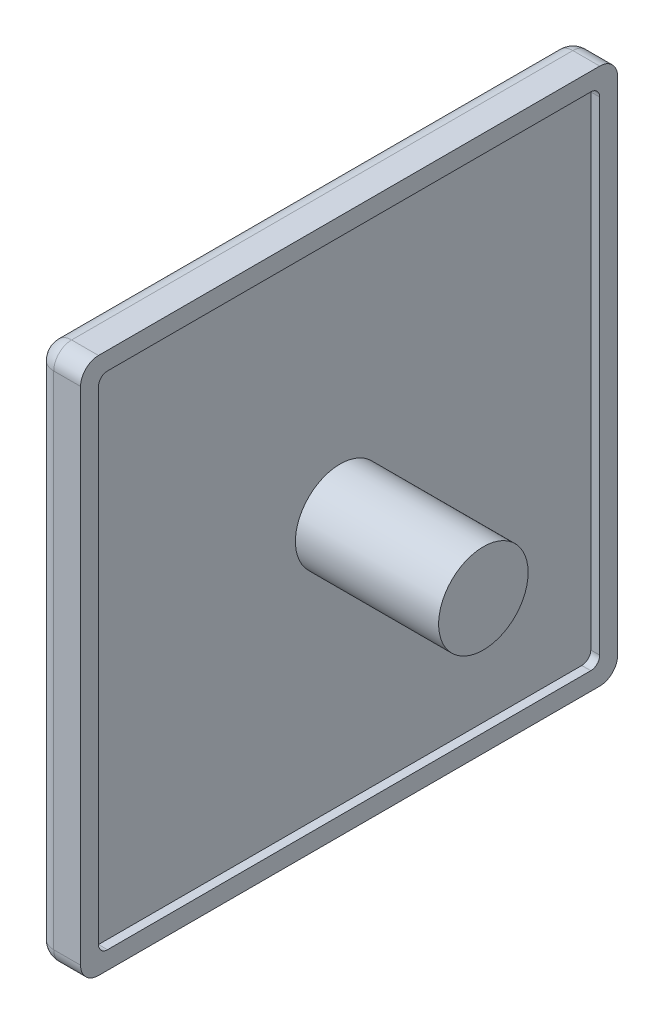
ISO-10303-21;
HEADER;
FILE_DESCRIPTION(('STEP AP214'),'2;1');
FILE_NAME('part.step','',(''),(''),'','','');
FILE_SCHEMA(('AUTOMOTIVE_DESIGN { 1 0 10303 214 1 1 1 1 }'));
ENDSEC;
DATA;
#1=APPLICATION_CONTEXT('core data for automotive mechanical design processes');
#2=APPLICATION_PROTOCOL_DEFINITION('international standard','automotive_design',2000,#1);
#3=PRODUCT_CONTEXT('',#1,'mechanical');
#4=PRODUCT('Part','Part','',(#3));
#5=PRODUCT_RELATED_PRODUCT_CATEGORY('part','',(#4));
#6=PRODUCT_DEFINITION_FORMATION('','',#4);
#7=PRODUCT_DEFINITION_CONTEXT('part definition',#1,'design');
#8=PRODUCT_DEFINITION('design','',#6,#7);
#9=PRODUCT_DEFINITION_SHAPE('','',#8);
#10=(LENGTH_UNIT() NAMED_UNIT(*) SI_UNIT(.MILLI.,.METRE.));
#11=(NAMED_UNIT(*) PLANE_ANGLE_UNIT() SI_UNIT($,.RADIAN.));
#12=(NAMED_UNIT(*) SI_UNIT($,.STERADIAN.) SOLID_ANGLE_UNIT());
#13=UNCERTAINTY_MEASURE_WITH_UNIT(LENGTH_MEASURE(1.E-05),#10,'distance_accuracy_value','');
#14=(GEOMETRIC_REPRESENTATION_CONTEXT(3) GLOBAL_UNCERTAINTY_ASSIGNED_CONTEXT((#13)) GLOBAL_UNIT_ASSIGNED_CONTEXT((#10,
#11,#12)) REPRESENTATION_CONTEXT('',''));
#15=CARTESIAN_POINT('',(0.,0.,0.));
#16=DIRECTION('',(0.,0.,1.));
#17=DIRECTION('',(1.,0.,0.));
#18=AXIS2_PLACEMENT_3D('',#15,#16,#17);
#19=CARTESIAN_POINT('',(2.5,0.,0.));
#20=DIRECTION('',(0.,0.,-1.));
#21=DIRECTION('',(-1.,0.,0.));
#22=AXIS2_PLACEMENT_3D('',#19,#20,#21);
#23=PLANE('',#22);
#24=DIRECTION('',(0.,-1.,0.));
#25=VECTOR('',#24,1.);
#26=CARTESIAN_POINT('',(2.5,0.,0.));
#27=LINE('',#26,#25);
#28=CARTESIAN_POINT('',(2.5,29.,0.));
#29=VERTEX_POINT('',#28);
#30=CARTESIAN_POINT('',(2.5,1.,0.));
#31=VERTEX_POINT('',#30);
#32=EDGE_CURVE('E326',#29,#31,#27,.T.);
#33=ORIENTED_EDGE('',*,*,#32,.F.);
#34=DIRECTION('',(-1.,0.,0.));
#35=VECTOR('',#34,1.);
#36=CARTESIAN_POINT('',(2.5,29.,0.));
#37=LINE('',#36,#35);
#38=CARTESIAN_POINT('',(1.,29.,0.));
#39=VERTEX_POINT('',#38);
#40=EDGE_CURVE('E228',#29,#39,#37,.T.);
#41=ORIENTED_EDGE('',*,*,#40,.T.);
#42=DIRECTION('',(0.,-1.,0.));
#43=VECTOR('',#42,1.);
#44=CARTESIAN_POINT('',(1.,0.,0.));
#45=LINE('',#44,#43);
#46=CARTESIAN_POINT('',(1.,1.,0.));
#47=VERTEX_POINT('',#46);
#48=EDGE_CURVE('E176',#39,#47,#45,.T.);
#49=ORIENTED_EDGE('',*,*,#48,.T.);
#50=DIRECTION('',(-1.,0.,0.));
#51=VECTOR('',#50,1.);
#52=CARTESIAN_POINT('',(2.5,1.,0.));
#53=LINE('',#52,#51);
#54=EDGE_CURVE('E226',#47,#31,#53,.F.);
#55=ORIENTED_EDGE('',*,*,#54,.T.);
#56=EDGE_LOOP('',(#33,#41,#49,#55));
#57=FACE_BOUND('',#56,.T.);
#58=ADVANCED_FACE('F41',(#57),#23,.F.);
#59=CARTESIAN_POINT('',(2.5,0.,0.));
#60=DIRECTION('',(0.,1.,0.));
#61=DIRECTION('',(0.,0.,1.));
#62=AXIS2_PLACEMENT_3D('',#59,#60,#61);
#63=PLANE('',#62);
#64=DIRECTION('',(0.,0.,-1.));
#65=VECTOR('',#64,1.);
#66=CARTESIAN_POINT('',(1.,0.,-30.));
#67=LINE('',#66,#65);
#68=CARTESIAN_POINT('',(1.,0.,-1.));
#69=VERTEX_POINT('',#68);
#70=CARTESIAN_POINT('',(1.,0.,-29.));
#71=VERTEX_POINT('',#70);
#72=EDGE_CURVE('E187',#69,#71,#67,.T.);
#73=ORIENTED_EDGE('',*,*,#72,.T.);
#74=DIRECTION('',(-1.,0.,0.));
#75=VECTOR('',#74,1.);
#76=CARTESIAN_POINT('',(2.5,0.,-29.));
#77=LINE('',#76,#75);
#78=CARTESIAN_POINT('',(2.5,0.,-29.));
#79=VERTEX_POINT('',#78);
#80=EDGE_CURVE('E248',#71,#79,#77,.F.);
#81=ORIENTED_EDGE('',*,*,#80,.T.);
#82=DIRECTION('',(0.,0.,-1.));
#83=VECTOR('',#82,1.);
#84=CARTESIAN_POINT('',(2.5,0.,0.));
#85=LINE('',#84,#83);
#86=CARTESIAN_POINT('',(2.5,0.,-1.));
#87=VERTEX_POINT('',#86);
#88=EDGE_CURVE('E335',#87,#79,#85,.T.);
#89=ORIENTED_EDGE('',*,*,#88,.F.);
#90=DIRECTION('',(-1.,0.,0.));
#91=VECTOR('',#90,1.);
#92=CARTESIAN_POINT('',(2.5,0.,-1.));
#93=LINE('',#92,#91);
#94=EDGE_CURVE('E246',#87,#69,#93,.T.);
#95=ORIENTED_EDGE('',*,*,#94,.T.);
#96=EDGE_LOOP('',(#73,#81,#89,#95));
#97=FACE_BOUND('',#96,.T.);
#98=ADVANCED_FACE('F373',(#97),#63,.F.);
#99=CARTESIAN_POINT('',(2.5,0.,-30.));
#100=DIRECTION('',(0.,0.,1.));
#101=DIRECTION('',(1.,0.,0.));
#102=AXIS2_PLACEMENT_3D('',#99,#100,#101);
#103=PLANE('',#102);
#104=DIRECTION('',(0.,1.,0.));
#105=VECTOR('',#104,1.);
#106=CARTESIAN_POINT('',(1.,30.,-30.));
#107=LINE('',#106,#105);
#108=CARTESIAN_POINT('',(1.,1.,-30.));
#109=VERTEX_POINT('',#108);
#110=CARTESIAN_POINT('',(1.,29.,-30.));
#111=VERTEX_POINT('',#110);
#112=EDGE_CURVE('E205',#109,#111,#107,.T.);
#113=ORIENTED_EDGE('',*,*,#112,.T.);
#114=DIRECTION('',(-1.,0.,0.));
#115=VECTOR('',#114,1.);
#116=CARTESIAN_POINT('',(2.5,29.,-30.));
#117=LINE('',#116,#115);
#118=CARTESIAN_POINT('',(2.5,29.,-30.));
#119=VERTEX_POINT('',#118);
#120=EDGE_CURVE('E244',#111,#119,#117,.F.);
#121=ORIENTED_EDGE('',*,*,#120,.T.);
#122=DIRECTION('',(0.,1.,0.));
#123=VECTOR('',#122,1.);
#124=CARTESIAN_POINT('',(2.5,0.,-30.));
#125=LINE('',#124,#123);
#126=CARTESIAN_POINT('',(2.5,1.,-30.));
#127=VERTEX_POINT('',#126);
#128=EDGE_CURVE('E338',#127,#119,#125,.T.);
#129=ORIENTED_EDGE('',*,*,#128,.F.);
#130=DIRECTION('',(-1.,0.,0.));
#131=VECTOR('',#130,1.);
#132=CARTESIAN_POINT('',(2.5,1.,-30.));
#133=LINE('',#132,#131);
#134=EDGE_CURVE('E242',#127,#109,#133,.T.);
#135=ORIENTED_EDGE('',*,*,#134,.T.);
#136=EDGE_LOOP('',(#113,#121,#129,#135));
#137=FACE_BOUND('',#136,.T.);
#138=ADVANCED_FACE('F361',(#137),#103,.F.);
#139=CARTESIAN_POINT('',(2.5,30.,0.));
#140=DIRECTION('',(0.,-1.,0.));
#141=DIRECTION('',(0.,0.,-1.));
#142=AXIS2_PLACEMENT_3D('',#139,#140,#141);
#143=PLANE('',#142);
#144=DIRECTION('',(0.,0.,1.));
#145=VECTOR('',#144,1.);
#146=CARTESIAN_POINT('',(1.,30.,0.));
#147=LINE('',#146,#145);
#148=CARTESIAN_POINT('',(1.,30.,-29.));
#149=VERTEX_POINT('',#148);
#150=CARTESIAN_POINT('',(1.,30.,-1.));
#151=VERTEX_POINT('',#150);
#152=EDGE_CURVE('E208',#149,#151,#147,.T.);
#153=ORIENTED_EDGE('',*,*,#152,.T.);
#154=DIRECTION('',(-1.,0.,0.));
#155=VECTOR('',#154,1.);
#156=CARTESIAN_POINT('',(2.5,30.,-1.));
#157=LINE('',#156,#155);
#158=CARTESIAN_POINT('',(2.5,30.,-1.));
#159=VERTEX_POINT('',#158);
#160=EDGE_CURVE('E232',#151,#159,#157,.F.);
#161=ORIENTED_EDGE('',*,*,#160,.T.);
#162=DIRECTION('',(0.,0.,1.));
#163=VECTOR('',#162,1.);
#164=CARTESIAN_POINT('',(2.5,30.,0.));
#165=LINE('',#164,#163);
#166=CARTESIAN_POINT('',(2.5,30.,-29.));
#167=VERTEX_POINT('',#166);
#168=EDGE_CURVE('E341',#167,#159,#165,.T.);
#169=ORIENTED_EDGE('',*,*,#168,.F.);
#170=DIRECTION('',(-1.,0.,0.));
#171=VECTOR('',#170,1.);
#172=CARTESIAN_POINT('',(2.5,30.,-29.));
#173=LINE('',#172,#171);
#174=EDGE_CURVE('E230',#167,#149,#173,.T.);
#175=ORIENTED_EDGE('',*,*,#174,.T.);
#176=EDGE_LOOP('',(#153,#161,#169,#175));
#177=FACE_BOUND('',#176,.T.);
#178=ADVANCED_FACE('F392',(#177),#143,.F.);
#179=CARTESIAN_POINT('',(2.5,0.,0.));
#180=DIRECTION('',(-1.,0.,0.));
#181=DIRECTION('',(0.,0.,1.));
#182=AXIS2_PLACEMENT_3D('',#179,#180,#181);
#183=PLANE('',#182);
#184=DIRECTION('',(0.,0.,-1.));
#185=VECTOR('',#184,1.);
#186=CARTESIAN_POINT('',(2.5,1.,-1.));
#187=LINE('',#186,#185);
#188=CARTESIAN_POINT('',(2.5,1.,-1.5));
#189=VERTEX_POINT('',#188);
#190=CARTESIAN_POINT('',(2.5,1.,-28.5));
#191=VERTEX_POINT('',#190);
#192=EDGE_CURVE('E328',#189,#191,#187,.T.);
#193=ORIENTED_EDGE('',*,*,#192,.F.);
#194=CARTESIAN_POINT('',(2.5,1.5,-1.5));
#195=DIRECTION('',(-1.,0.,0.));
#196=DIRECTION('',(0.,0.,1.));
#197=AXIS2_PLACEMENT_3D('',#194,#195,#196);
#198=CIRCLE('',#197,0.5);
#199=CARTESIAN_POINT('',(2.5,1.50000000000001,-1.));
#200=VERTEX_POINT('',#199);
#201=EDGE_CURVE('E11',#189,#200,#198,.T.);
#202=ORIENTED_EDGE('',*,*,#201,.T.);
#203=DIRECTION('',(0.,-1.,0.));
#204=VECTOR('',#203,1.);
#205=CARTESIAN_POINT('',(2.5,29.,-1.));
#206=LINE('',#205,#204);
#207=CARTESIAN_POINT('',(2.5,28.5,-1.));
#208=VERTEX_POINT('',#207);
#209=EDGE_CURVE('E254',#208,#200,#206,.T.);
#210=ORIENTED_EDGE('',*,*,#209,.F.);
#211=CARTESIAN_POINT('',(2.5,28.5,-1.5));
#212=DIRECTION('',(-1.,0.,0.));
#213=DIRECTION('',(0.,0.,1.));
#214=AXIS2_PLACEMENT_3D('',#211,#212,#213);
#215=CIRCLE('',#214,0.5);
#216=CARTESIAN_POINT('',(2.5,29.,-1.5));
#217=VERTEX_POINT('',#216);
#218=EDGE_CURVE('E49',#208,#217,#215,.T.);
#219=ORIENTED_EDGE('',*,*,#218,.T.);
#220=DIRECTION('',(0.,0.,1.));
#221=VECTOR('',#220,1.);
#222=CARTESIAN_POINT('',(2.5,29.,-1.));
#223=LINE('',#222,#221);
#224=CARTESIAN_POINT('',(2.5,29.,-28.5));
#225=VERTEX_POINT('',#224);
#226=EDGE_CURVE('E294',#225,#217,#223,.T.);
#227=ORIENTED_EDGE('',*,*,#226,.F.);
#228=CARTESIAN_POINT('',(2.5,28.5,-28.5));
#229=DIRECTION('',(-1.,0.,0.));
#230=DIRECTION('',(0.,0.,1.));
#231=AXIS2_PLACEMENT_3D('',#228,#229,#230);
#232=CIRCLE('',#231,0.5);
#233=CARTESIAN_POINT('',(2.5,28.5,-29.));
#234=VERTEX_POINT('',#233);
#235=EDGE_CURVE('E289',#225,#234,#232,.T.);
#236=ORIENTED_EDGE('',*,*,#235,.T.);
#237=DIRECTION('',(0.,1.,0.));
#238=VECTOR('',#237,1.);
#239=CARTESIAN_POINT('',(2.5,29.,-29.));
#240=LINE('',#239,#238);
#241=CARTESIAN_POINT('',(2.5,1.50000000000001,-29.));
#242=VERTEX_POINT('',#241);
#243=EDGE_CURVE('E301',#242,#234,#240,.T.);
#244=ORIENTED_EDGE('',*,*,#243,.F.);
#245=CARTESIAN_POINT('',(2.5,1.5,-28.5));
#246=DIRECTION('',(-1.,0.,0.));
#247=DIRECTION('',(0.,0.,1.));
#248=AXIS2_PLACEMENT_3D('',#245,#246,#247);
#249=CIRCLE('',#248,0.5);
#250=EDGE_CURVE('E287',#242,#191,#249,.T.);
#251=ORIENTED_EDGE('',*,*,#250,.T.);
#252=EDGE_LOOP('',(#193,#202,#210,#219,#227,#236,#244,#251));
#253=FACE_BOUND('',#252,.T.);
#254=ORIENTED_EDGE('',*,*,#168,.T.);
#255=CARTESIAN_POINT('',(2.5,29.,-1.));
#256=DIRECTION('',(-1.,0.,0.));
#257=DIRECTION('',(0.,0.,1.));
#258=AXIS2_PLACEMENT_3D('',#255,#256,#257);
#259=CIRCLE('',#258,1.);
#260=EDGE_CURVE('E240',#159,#29,#259,.F.);
#261=ORIENTED_EDGE('',*,*,#260,.T.);
#262=ORIENTED_EDGE('',*,*,#32,.T.);
#263=CARTESIAN_POINT('',(2.5,1.,-1.));
#264=DIRECTION('',(-1.,0.,0.));
#265=DIRECTION('',(0.,0.,1.));
#266=AXIS2_PLACEMENT_3D('',#263,#264,#265);
#267=CIRCLE('',#266,1.);
#268=EDGE_CURVE('E234',#31,#87,#267,.F.);
#269=ORIENTED_EDGE('',*,*,#268,.T.);
#270=ORIENTED_EDGE('',*,*,#88,.T.);
#271=CARTESIAN_POINT('',(2.5,1.,-29.));
#272=DIRECTION('',(-1.,0.,0.));
#273=DIRECTION('',(0.,0.,1.));
#274=AXIS2_PLACEMENT_3D('',#271,#272,#273);
#275=CIRCLE('',#274,1.);
#276=EDGE_CURVE('E236',#79,#127,#275,.F.);
#277=ORIENTED_EDGE('',*,*,#276,.T.);
#278=ORIENTED_EDGE('',*,*,#128,.T.);
#279=CARTESIAN_POINT('',(2.5,29.,-29.));
#280=DIRECTION('',(-1.,0.,0.));
#281=DIRECTION('',(0.,0.,1.));
#282=AXIS2_PLACEMENT_3D('',#279,#280,#281);
#283=CIRCLE('',#282,1.);
#284=EDGE_CURVE('E238',#119,#167,#283,.F.);
#285=ORIENTED_EDGE('',*,*,#284,.T.);
#286=EDGE_LOOP('',(#254,#261,#262,#269,#270,#277,#278,#285));
#287=FACE_BOUND('',#286,.T.);
#288=ADVANCED_FACE('F292',(#253,#287),#183,.F.);
#289=CARTESIAN_POINT('',(0.,0.,0.));
#290=DIRECTION('',(-1.,0.,0.));
#291=DIRECTION('',(0.,0.,1.));
#292=AXIS2_PLACEMENT_3D('',#289,#290,#291);
#293=PLANE('',#292);
#294=DIRECTION('',(0.,1.,0.));
#295=VECTOR('',#294,1.);
#296=CARTESIAN_POINT('',(0.,0.,-29.));
#297=LINE('',#296,#295);
#298=CARTESIAN_POINT('',(0.,29.,-29.));
#299=VERTEX_POINT('',#298);
#300=CARTESIAN_POINT('',(0.,1.,-29.));
#301=VERTEX_POINT('',#300);
#302=EDGE_CURVE('E204',#299,#301,#297,.F.);
#303=ORIENTED_EDGE('',*,*,#302,.T.);
#304=DIRECTION('',(0.,0.,-1.));
#305=VECTOR('',#304,1.);
#306=CARTESIAN_POINT('',(0.,1.,0.));
#307=LINE('',#306,#305);
#308=CARTESIAN_POINT('',(0.,1.,-1.));
#309=VERTEX_POINT('',#308);
#310=EDGE_CURVE('E184',#301,#309,#307,.F.);
#311=ORIENTED_EDGE('',*,*,#310,.T.);
#312=DIRECTION('',(0.,-1.,0.));
#313=VECTOR('',#312,1.);
#314=CARTESIAN_POINT('',(0.,30.,-1.));
#315=LINE('',#314,#313);
#316=CARTESIAN_POINT('',(0.,29.,-1.));
#317=VERTEX_POINT('',#316);
#318=EDGE_CURVE('E193',#309,#317,#315,.F.);
#319=ORIENTED_EDGE('',*,*,#318,.T.);
#320=DIRECTION('',(0.,0.,1.));
#321=VECTOR('',#320,1.);
#322=CARTESIAN_POINT('',(0.,29.,-30.));
#323=LINE('',#322,#321);
#324=EDGE_CURVE('E199',#317,#299,#323,.F.);
#325=ORIENTED_EDGE('',*,*,#324,.T.);
#326=EDGE_LOOP('',(#303,#311,#319,#325));
#327=FACE_BOUND('',#326,.T.);
#328=ADVANCED_FACE('F202',(#327),#293,.T.);
#329=CARTESIAN_POINT('',(2.,29.,-1.));
#330=DIRECTION('',(0.,0.,1.));
#331=DIRECTION('',(0.,-1.,0.));
#332=AXIS2_PLACEMENT_3D('',#329,#330,#331);
#333=PLANE('',#332);
#334=DIRECTION('',(0.,-1.,0.));
#335=VECTOR('',#334,1.);
#336=CARTESIAN_POINT('',(2.,29.,-1.));
#337=LINE('',#336,#335);
#338=CARTESIAN_POINT('',(2.,28.5,-1.));
#339=VERTEX_POINT('',#338);
#340=CARTESIAN_POINT('',(2.,1.50000000000001,-1.));
#341=VERTEX_POINT('',#340);
#342=EDGE_CURVE('E300',#339,#341,#337,.T.);
#343=ORIENTED_EDGE('',*,*,#342,.F.);
#344=DIRECTION('',(1.,0.,0.));
#345=VECTOR('',#344,1.);
#346=CARTESIAN_POINT('',(2.5,28.5,-1.));
#347=LINE('',#346,#345);
#348=EDGE_CURVE('E285',#339,#208,#347,.T.);
#349=ORIENTED_EDGE('',*,*,#348,.T.);
#350=ORIENTED_EDGE('',*,*,#209,.T.);
#351=DIRECTION('',(1.,0.,0.));
#352=VECTOR('',#351,1.);
#353=CARTESIAN_POINT('',(2.,1.5,-1.));
#354=LINE('',#353,#352);
#355=EDGE_CURVE('E283',#200,#341,#354,.F.);
#356=ORIENTED_EDGE('',*,*,#355,.T.);
#357=EDGE_LOOP('',(#343,#349,#350,#356));
#358=FACE_BOUND('',#357,.T.);
#359=ADVANCED_FACE('F313',(#358),#333,.F.);
#360=CARTESIAN_POINT('',(2.,29.,-1.));
#361=DIRECTION('',(0.,1.,0.));
#362=DIRECTION('',(0.,0.,1.));
#363=AXIS2_PLACEMENT_3D('',#360,#361,#362);
#364=PLANE('',#363);
#365=DIRECTION('',(0.,0.,1.));
#366=VECTOR('',#365,1.);
#367=CARTESIAN_POINT('',(2.,29.,-1.));
#368=LINE('',#367,#366);
#369=CARTESIAN_POINT('',(2.,29.,-28.5));
#370=VERTEX_POINT('',#369);
#371=CARTESIAN_POINT('',(2.,29.,-1.5));
#372=VERTEX_POINT('',#371);
#373=EDGE_CURVE('E311',#370,#372,#368,.T.);
#374=ORIENTED_EDGE('',*,*,#373,.F.);
#375=DIRECTION('',(1.,0.,0.));
#376=VECTOR('',#375,1.);
#377=CARTESIAN_POINT('',(2.5,29.,-28.5));
#378=LINE('',#377,#376);
#379=EDGE_CURVE('E280',#370,#225,#378,.T.);
#380=ORIENTED_EDGE('',*,*,#379,.T.);
#381=ORIENTED_EDGE('',*,*,#226,.T.);
#382=DIRECTION('',(1.,0.,0.));
#383=VECTOR('',#382,1.);
#384=CARTESIAN_POINT('',(2.,29.,-1.5));
#385=LINE('',#384,#383);
#386=EDGE_CURVE('E278',#217,#372,#385,.F.);
#387=ORIENTED_EDGE('',*,*,#386,.T.);
#388=EDGE_LOOP('',(#374,#380,#381,#387));
#389=FACE_BOUND('',#388,.T.);
#390=ADVANCED_FACE('F297',(#389),#364,.F.);
#391=CARTESIAN_POINT('',(2.,29.,-29.));
#392=DIRECTION('',(0.,0.,-1.));
#393=DIRECTION('',(0.,1.,0.));
#394=AXIS2_PLACEMENT_3D('',#391,#392,#393);
#395=PLANE('',#394);
#396=DIRECTION('',(0.,1.,0.));
#397=VECTOR('',#396,1.);
#398=CARTESIAN_POINT('',(2.,29.,-29.));
#399=LINE('',#398,#397);
#400=CARTESIAN_POINT('',(2.,1.50000000000001,-29.));
#401=VERTEX_POINT('',#400);
#402=CARTESIAN_POINT('',(2.,28.5,-29.));
#403=VERTEX_POINT('',#402);
#404=EDGE_CURVE('E317',#401,#403,#399,.T.);
#405=ORIENTED_EDGE('',*,*,#404,.F.);
#406=DIRECTION('',(1.,0.,0.));
#407=VECTOR('',#406,1.);
#408=CARTESIAN_POINT('',(2.5,1.5,-29.));
#409=LINE('',#408,#407);
#410=EDGE_CURVE('E262',#401,#242,#409,.T.);
#411=ORIENTED_EDGE('',*,*,#410,.T.);
#412=ORIENTED_EDGE('',*,*,#243,.T.);
#413=DIRECTION('',(1.,0.,0.));
#414=VECTOR('',#413,1.);
#415=CARTESIAN_POINT('',(2.,28.5,-29.));
#416=LINE('',#415,#414);
#417=EDGE_CURVE('E250',#234,#403,#416,.F.);
#418=ORIENTED_EDGE('',*,*,#417,.T.);
#419=EDGE_LOOP('',(#405,#411,#412,#418));
#420=FACE_BOUND('',#419,.T.);
#421=ADVANCED_FACE('F462',(#420),#395,.F.);
#422=CARTESIAN_POINT('',(2.,1.,-1.));
#423=DIRECTION('',(0.,-1.,0.));
#424=DIRECTION('',(0.,0.,-1.));
#425=AXIS2_PLACEMENT_3D('',#422,#423,#424);
#426=PLANE('',#425);
#427=ORIENTED_EDGE('',*,*,#192,.T.);
#428=DIRECTION('',(1.,0.,0.));
#429=VECTOR('',#428,1.);
#430=CARTESIAN_POINT('',(2.,1.,-28.5));
#431=LINE('',#430,#429);
#432=CARTESIAN_POINT('',(2.,1.,-28.5));
#433=VERTEX_POINT('',#432);
#434=EDGE_CURVE('E268',#191,#433,#431,.F.);
#435=ORIENTED_EDGE('',*,*,#434,.T.);
#436=DIRECTION('',(0.,0.,-1.));
#437=VECTOR('',#436,1.);
#438=CARTESIAN_POINT('',(2.,1.,-1.));
#439=LINE('',#438,#437);
#440=CARTESIAN_POINT('',(2.,1.,-1.5));
#441=VERTEX_POINT('',#440);
#442=EDGE_CURVE('E315',#441,#433,#439,.T.);
#443=ORIENTED_EDGE('',*,*,#442,.F.);
#444=DIRECTION('',(1.,0.,0.));
#445=VECTOR('',#444,1.);
#446=CARTESIAN_POINT('',(2.5,1.,-1.5));
#447=LINE('',#446,#445);
#448=EDGE_CURVE('E265',#441,#189,#447,.T.);
#449=ORIENTED_EDGE('',*,*,#448,.T.);
#450=EDGE_LOOP('',(#427,#435,#443,#449));
#451=FACE_BOUND('',#450,.T.);
#452=ADVANCED_FACE('F456',(#451),#426,.F.);
#453=CARTESIAN_POINT('',(2.,0.,0.));
#454=DIRECTION('',(1.,0.,0.));
#455=DIRECTION('',(0.,0.,-1.));
#456=AXIS2_PLACEMENT_3D('',#453,#454,#455);
#457=PLANE('',#456);
#458=CARTESIAN_POINT('',(2.,15.,-15.));
#459=DIRECTION('',(1.,0.,0.));
#460=DIRECTION('',(0.,0.,-1.));
#461=AXIS2_PLACEMENT_3D('',#458,#459,#460);
#462=CIRCLE('',#461,2.5);
#463=CARTESIAN_POINT('',(2.,15.,-17.5));
#464=VERTEX_POINT('',#463);
#465=EDGE_CURVE('E320',#464,#464,#462,.T.);
#466=ORIENTED_EDGE('',*,*,#465,.F.);
#467=EDGE_LOOP('',(#466));
#468=FACE_BOUND('',#467,.T.);
#469=ORIENTED_EDGE('',*,*,#442,.T.);
#470=CARTESIAN_POINT('',(2.,1.5,-28.5));
#471=DIRECTION('',(1.,0.,0.));
#472=DIRECTION('',(0.,0.,-1.));
#473=AXIS2_PLACEMENT_3D('',#470,#471,#472);
#474=CIRCLE('',#473,0.5);
#475=EDGE_CURVE('E276',#433,#401,#474,.T.);
#476=ORIENTED_EDGE('',*,*,#475,.T.);
#477=ORIENTED_EDGE('',*,*,#404,.T.);
#478=CARTESIAN_POINT('',(2.,28.5,-28.5));
#479=DIRECTION('',(1.,0.,0.));
#480=DIRECTION('',(0.,0.,-1.));
#481=AXIS2_PLACEMENT_3D('',#478,#479,#480);
#482=CIRCLE('',#481,0.5);
#483=EDGE_CURVE('E274',#403,#370,#482,.T.);
#484=ORIENTED_EDGE('',*,*,#483,.T.);
#485=ORIENTED_EDGE('',*,*,#373,.T.);
#486=CARTESIAN_POINT('',(2.,28.5,-1.5));
#487=DIRECTION('',(1.,0.,0.));
#488=DIRECTION('',(0.,0.,-1.));
#489=AXIS2_PLACEMENT_3D('',#486,#487,#488);
#490=CIRCLE('',#489,0.5);
#491=EDGE_CURVE('E272',#372,#339,#490,.T.);
#492=ORIENTED_EDGE('',*,*,#491,.T.);
#493=ORIENTED_EDGE('',*,*,#342,.T.);
#494=CARTESIAN_POINT('',(2.,1.5,-1.5));
#495=DIRECTION('',(1.,0.,0.));
#496=DIRECTION('',(0.,0.,-1.));
#497=AXIS2_PLACEMENT_3D('',#494,#495,#496);
#498=CIRCLE('',#497,0.5);
#499=EDGE_CURVE('E270',#341,#441,#498,.T.);
#500=ORIENTED_EDGE('',*,*,#499,.T.);
#501=EDGE_LOOP('',(#469,#476,#477,#484,#485,#492,#493,#500));
#502=FACE_BOUND('',#501,.T.);
#503=ADVANCED_FACE('F309',(#468,#502),#457,.T.);
#504=CARTESIAN_POINT('',(1.,29.,0.));
#505=DIRECTION('',(0.,0.,-1.));
#506=DIRECTION('',(-1.,0.,0.));
#507=AXIS2_PLACEMENT_3D('',#504,#505,#506);
#508=CYLINDRICAL_SURFACE('',#507,1.);
#509=ORIENTED_EDGE('',*,*,#324,.F.);
#510=CARTESIAN_POINT('',(1.,29.,-1.));
#511=DIRECTION('',(0.,0.,-1.));
#512=DIRECTION('',(-1.,0.,0.));
#513=AXIS2_PLACEMENT_3D('',#510,#511,#512);
#514=CIRCLE('',#513,1.);
#515=EDGE_CURVE('E219',#317,#151,#514,.T.);
#516=ORIENTED_EDGE('',*,*,#515,.T.);
#517=ORIENTED_EDGE('',*,*,#152,.F.);
#518=CARTESIAN_POINT('',(1.,29.,-29.));
#519=DIRECTION('',(0.,0.,-1.));
#520=DIRECTION('',(-1.,0.,0.));
#521=AXIS2_PLACEMENT_3D('',#518,#519,#520);
#522=CIRCLE('',#521,1.);
#523=EDGE_CURVE('E217',#149,#299,#522,.F.);
#524=ORIENTED_EDGE('',*,*,#523,.T.);
#525=EDGE_LOOP('',(#509,#516,#517,#524));
#526=FACE_BOUND('',#525,.T.);
#527=ADVANCED_FACE('F390',(#526),#508,.T.);
#528=CARTESIAN_POINT('',(1.,0.,-1.));
#529=DIRECTION('',(0.,1.,0.));
#530=DIRECTION('',(0.,0.,1.));
#531=AXIS2_PLACEMENT_3D('',#528,#529,#530);
#532=CYLINDRICAL_SURFACE('',#531,1.);
#533=ORIENTED_EDGE('',*,*,#48,.F.);
#534=CARTESIAN_POINT('',(1.,29.,-1.));
#535=DIRECTION('',(0.,1.,0.));
#536=DIRECTION('',(0.,0.,1.));
#537=AXIS2_PLACEMENT_3D('',#534,#535,#536);
#538=CIRCLE('',#537,1.);
#539=EDGE_CURVE('E175',#39,#317,#538,.F.);
#540=ORIENTED_EDGE('',*,*,#539,.T.);
#541=ORIENTED_EDGE('',*,*,#318,.F.);
#542=CARTESIAN_POINT('',(1.,1.,-1.));
#543=DIRECTION('',(0.,1.,0.));
#544=DIRECTION('',(0.,0.,1.));
#545=AXIS2_PLACEMENT_3D('',#542,#543,#544);
#546=CIRCLE('',#545,1.);
#547=EDGE_CURVE('E165',#309,#47,#546,.T.);
#548=ORIENTED_EDGE('',*,*,#547,.T.);
#549=EDGE_LOOP('',(#533,#540,#541,#548));
#550=FACE_BOUND('',#549,.T.);
#551=ADVANCED_FACE('F194',(#550),#532,.T.);
#552=CARTESIAN_POINT('',(1.,0.,-29.));
#553=DIRECTION('',(0.,-1.,0.));
#554=DIRECTION('',(0.,0.,-1.));
#555=AXIS2_PLACEMENT_3D('',#552,#553,#554);
#556=CYLINDRICAL_SURFACE('',#555,1.);
#557=ORIENTED_EDGE('',*,*,#302,.F.);
#558=CARTESIAN_POINT('',(1.,29.,-29.));
#559=DIRECTION('',(0.,-1.,0.));
#560=DIRECTION('',(0.,0.,-1.));
#561=AXIS2_PLACEMENT_3D('',#558,#559,#560);
#562=CIRCLE('',#561,1.);
#563=EDGE_CURVE('E189',#299,#111,#562,.T.);
#564=ORIENTED_EDGE('',*,*,#563,.T.);
#565=ORIENTED_EDGE('',*,*,#112,.F.);
#566=CARTESIAN_POINT('',(1.,1.,-29.));
#567=DIRECTION('',(0.,-1.,0.));
#568=DIRECTION('',(0.,0.,-1.));
#569=AXIS2_PLACEMENT_3D('',#566,#567,#568);
#570=CIRCLE('',#569,1.);
#571=EDGE_CURVE('E221',#109,#301,#570,.F.);
#572=ORIENTED_EDGE('',*,*,#571,.T.);
#573=EDGE_LOOP('',(#557,#564,#565,#572));
#574=FACE_BOUND('',#573,.T.);
#575=ADVANCED_FACE('F347',(#574),#556,.T.);
#576=CARTESIAN_POINT('',(1.,1.,0.));
#577=DIRECTION('',(0.,0.,1.));
#578=DIRECTION('',(1.,0.,0.));
#579=AXIS2_PLACEMENT_3D('',#576,#577,#578);
#580=CYLINDRICAL_SURFACE('',#579,1.);
#581=ORIENTED_EDGE('',*,*,#310,.F.);
#582=CARTESIAN_POINT('',(1.,1.,-29.));
#583=DIRECTION('',(0.,0.,1.));
#584=DIRECTION('',(1.,0.,0.));
#585=AXIS2_PLACEMENT_3D('',#582,#583,#584);
#586=CIRCLE('',#585,1.);
#587=EDGE_CURVE('E188',#301,#71,#586,.T.);
#588=ORIENTED_EDGE('',*,*,#587,.T.);
#589=ORIENTED_EDGE('',*,*,#72,.F.);
#590=CARTESIAN_POINT('',(1.,1.,-1.));
#591=DIRECTION('',(0.,0.,1.));
#592=DIRECTION('',(1.,0.,0.));
#593=AXIS2_PLACEMENT_3D('',#590,#591,#592);
#594=CIRCLE('',#593,1.);
#595=EDGE_CURVE('E168',#69,#309,#594,.F.);
#596=ORIENTED_EDGE('',*,*,#595,.T.);
#597=EDGE_LOOP('',(#581,#588,#589,#596));
#598=FACE_BOUND('',#597,.T.);
#599=ADVANCED_FACE('F181',(#598),#580,.T.);
#600=CARTESIAN_POINT('',(2.5,29.,-1.));
#601=DIRECTION('',(-1.,0.,0.));
#602=DIRECTION('',(0.,0.,1.));
#603=AXIS2_PLACEMENT_3D('',#600,#601,#602);
#604=CYLINDRICAL_SURFACE('',#603,1.);
#605=ORIENTED_EDGE('',*,*,#260,.F.);
#606=ORIENTED_EDGE('',*,*,#160,.F.);
#607=CARTESIAN_POINT('',(1.,29.,-1.));
#608=DIRECTION('',(-1.,0.,0.));
#609=DIRECTION('',(0.,0.,1.));
#610=AXIS2_PLACEMENT_3D('',#607,#608,#609);
#611=CIRCLE('',#610,1.);
#612=EDGE_CURVE('E251',#39,#151,#611,.T.);
#613=ORIENTED_EDGE('',*,*,#612,.F.);
#614=ORIENTED_EDGE('',*,*,#40,.F.);
#615=EDGE_LOOP('',(#605,#606,#613,#614));
#616=FACE_BOUND('',#615,.T.);
#617=ADVANCED_FACE('F385',(#616),#604,.T.);
#618=CARTESIAN_POINT('',(1.,29.,-1.));
#619=DIRECTION('',(0.,0.,1.));
#620=DIRECTION('',(1.,0.,0.));
#621=AXIS2_PLACEMENT_3D('',#618,#619,#620);
#622=SPHERICAL_SURFACE('',#621,1.);
#623=ORIENTED_EDGE('',*,*,#612,.T.);
#624=ORIENTED_EDGE('',*,*,#515,.F.);
#625=ORIENTED_EDGE('',*,*,#539,.F.);
#626=EDGE_LOOP('',(#623,#624,#625));
#627=FACE_BOUND('',#626,.T.);
#628=ADVANCED_FACE('F388',(#627),#622,.T.);
#629=CARTESIAN_POINT('',(2.5,29.,-29.));
#630=DIRECTION('',(-1.,0.,0.));
#631=DIRECTION('',(0.,0.,1.));
#632=AXIS2_PLACEMENT_3D('',#629,#630,#631);
#633=CYLINDRICAL_SURFACE('',#632,1.);
#634=ORIENTED_EDGE('',*,*,#284,.F.);
#635=ORIENTED_EDGE('',*,*,#120,.F.);
#636=CARTESIAN_POINT('',(1.,29.,-29.));
#637=DIRECTION('',(-1.,0.,0.));
#638=DIRECTION('',(0.,0.,1.));
#639=AXIS2_PLACEMENT_3D('',#636,#637,#638);
#640=CIRCLE('',#639,1.);
#641=EDGE_CURVE('E255',#149,#111,#640,.T.);
#642=ORIENTED_EDGE('',*,*,#641,.F.);
#643=ORIENTED_EDGE('',*,*,#174,.F.);
#644=EDGE_LOOP('',(#634,#635,#642,#643));
#645=FACE_BOUND('',#644,.T.);
#646=ADVANCED_FACE('F358',(#645),#633,.T.);
#647=CARTESIAN_POINT('',(1.,29.,-29.));
#648=DIRECTION('',(0.,0.,1.));
#649=DIRECTION('',(1.,0.,0.));
#650=AXIS2_PLACEMENT_3D('',#647,#648,#649);
#651=SPHERICAL_SURFACE('',#650,1.);
#652=ORIENTED_EDGE('',*,*,#563,.F.);
#653=ORIENTED_EDGE('',*,*,#523,.F.);
#654=ORIENTED_EDGE('',*,*,#641,.T.);
#655=EDGE_LOOP('',(#652,#653,#654));
#656=FACE_BOUND('',#655,.T.);
#657=ADVANCED_FACE('F352',(#656),#651,.T.);
#658=CARTESIAN_POINT('',(2.5,1.,-29.));
#659=DIRECTION('',(-1.,0.,0.));
#660=DIRECTION('',(0.,0.,1.));
#661=AXIS2_PLACEMENT_3D('',#658,#659,#660);
#662=CYLINDRICAL_SURFACE('',#661,1.);
#663=ORIENTED_EDGE('',*,*,#276,.F.);
#664=ORIENTED_EDGE('',*,*,#80,.F.);
#665=CARTESIAN_POINT('',(1.,1.,-29.));
#666=DIRECTION('',(-1.,0.,0.));
#667=DIRECTION('',(0.,0.,1.));
#668=AXIS2_PLACEMENT_3D('',#665,#666,#667);
#669=CIRCLE('',#668,1.);
#670=EDGE_CURVE('E257',#109,#71,#669,.T.);
#671=ORIENTED_EDGE('',*,*,#670,.F.);
#672=ORIENTED_EDGE('',*,*,#134,.F.);
#673=EDGE_LOOP('',(#663,#664,#671,#672));
#674=FACE_BOUND('',#673,.T.);
#675=ADVANCED_FACE('F368',(#674),#662,.T.);
#676=CARTESIAN_POINT('',(1.,1.,-29.));
#677=DIRECTION('',(0.,0.,1.));
#678=DIRECTION('',(1.,0.,0.));
#679=AXIS2_PLACEMENT_3D('',#676,#677,#678);
#680=SPHERICAL_SURFACE('',#679,1.);
#681=ORIENTED_EDGE('',*,*,#587,.F.);
#682=ORIENTED_EDGE('',*,*,#571,.F.);
#683=ORIENTED_EDGE('',*,*,#670,.T.);
#684=EDGE_LOOP('',(#681,#682,#683));
#685=FACE_BOUND('',#684,.T.);
#686=ADVANCED_FACE('F371',(#685),#680,.T.);
#687=CARTESIAN_POINT('',(2.5,1.,-1.));
#688=DIRECTION('',(-1.,0.,0.));
#689=DIRECTION('',(0.,0.,1.));
#690=AXIS2_PLACEMENT_3D('',#687,#688,#689);
#691=CYLINDRICAL_SURFACE('',#690,1.);
#692=ORIENTED_EDGE('',*,*,#268,.F.);
#693=ORIENTED_EDGE('',*,*,#54,.F.);
#694=CARTESIAN_POINT('',(1.,1.,-1.));
#695=DIRECTION('',(-1.,0.,0.));
#696=DIRECTION('',(0.,0.,1.));
#697=AXIS2_PLACEMENT_3D('',#694,#695,#696);
#698=CIRCLE('',#697,1.);
#699=EDGE_CURVE('E170',#69,#47,#698,.T.);
#700=ORIENTED_EDGE('',*,*,#699,.F.);
#701=ORIENTED_EDGE('',*,*,#94,.F.);
#702=EDGE_LOOP('',(#692,#693,#700,#701));
#703=FACE_BOUND('',#702,.T.);
#704=ADVANCED_FACE('F377',(#703),#691,.T.);
#705=CARTESIAN_POINT('',(1.,1.,-1.));
#706=DIRECTION('',(0.,0.,1.));
#707=DIRECTION('',(1.,0.,0.));
#708=AXIS2_PLACEMENT_3D('',#705,#706,#707);
#709=SPHERICAL_SURFACE('',#708,1.);
#710=ORIENTED_EDGE('',*,*,#699,.T.);
#711=ORIENTED_EDGE('',*,*,#547,.F.);
#712=ORIENTED_EDGE('',*,*,#595,.F.);
#713=EDGE_LOOP('',(#710,#711,#712));
#714=FACE_BOUND('',#713,.T.);
#715=ADVANCED_FACE('F167',(#714),#709,.T.);
#716=CARTESIAN_POINT('',(2.,1.5,-28.5));
#717=DIRECTION('',(-1.,0.,0.));
#718=DIRECTION('',(0.,0.,1.));
#719=AXIS2_PLACEMENT_3D('',#716,#717,#718);
#720=CYLINDRICAL_SURFACE('',#719,0.5);
#721=ORIENTED_EDGE('',*,*,#475,.F.);
#722=ORIENTED_EDGE('',*,*,#434,.F.);
#723=ORIENTED_EDGE('',*,*,#250,.F.);
#724=ORIENTED_EDGE('',*,*,#410,.F.);
#725=EDGE_LOOP('',(#721,#722,#723,#724));
#726=FACE_BOUND('',#725,.T.);
#727=ADVANCED_FACE('F431',(#726),#720,.F.);
#728=CARTESIAN_POINT('',(2.,28.5,-28.5));
#729=DIRECTION('',(-1.,0.,0.));
#730=DIRECTION('',(0.,0.,1.));
#731=AXIS2_PLACEMENT_3D('',#728,#729,#730);
#732=CYLINDRICAL_SURFACE('',#731,0.5);
#733=ORIENTED_EDGE('',*,*,#483,.F.);
#734=ORIENTED_EDGE('',*,*,#417,.F.);
#735=ORIENTED_EDGE('',*,*,#235,.F.);
#736=ORIENTED_EDGE('',*,*,#379,.F.);
#737=EDGE_LOOP('',(#733,#734,#735,#736));
#738=FACE_BOUND('',#737,.T.);
#739=ADVANCED_FACE('F436',(#738),#732,.F.);
#740=CARTESIAN_POINT('',(2.,28.5,-1.5));
#741=DIRECTION('',(-1.,0.,0.));
#742=DIRECTION('',(0.,0.,1.));
#743=AXIS2_PLACEMENT_3D('',#740,#741,#742);
#744=CYLINDRICAL_SURFACE('',#743,0.5);
#745=ORIENTED_EDGE('',*,*,#491,.F.);
#746=ORIENTED_EDGE('',*,*,#386,.F.);
#747=ORIENTED_EDGE('',*,*,#218,.F.);
#748=ORIENTED_EDGE('',*,*,#348,.F.);
#749=EDGE_LOOP('',(#745,#746,#747,#748));
#750=FACE_BOUND('',#749,.T.);
#751=ADVANCED_FACE('F304',(#750),#744,.F.);
#752=CARTESIAN_POINT('',(2.,1.5,-1.5));
#753=DIRECTION('',(-1.,0.,0.));
#754=DIRECTION('',(0.,0.,1.));
#755=AXIS2_PLACEMENT_3D('',#752,#753,#754);
#756=CYLINDRICAL_SURFACE('',#755,0.5);
#757=ORIENTED_EDGE('',*,*,#499,.F.);
#758=ORIENTED_EDGE('',*,*,#355,.F.);
#759=ORIENTED_EDGE('',*,*,#201,.F.);
#760=ORIENTED_EDGE('',*,*,#448,.F.);
#761=EDGE_LOOP('',(#757,#758,#759,#760));
#762=FACE_BOUND('',#761,.T.);
#763=ADVANCED_FACE('F43',(#762),#756,.F.);
#764=CARTESIAN_POINT('',(10.,15.,-15.));
#765=DIRECTION('',(-1.,0.,0.));
#766=DIRECTION('',(0.,0.,1.));
#767=AXIS2_PLACEMENT_3D('',#764,#765,#766);
#768=CYLINDRICAL_SURFACE('',#767,2.5);
#769=CARTESIAN_POINT('',(10.,15.,-15.));
#770=DIRECTION('',(1.,0.,0.));
#771=DIRECTION('',(0.,0.,-1.));
#772=AXIS2_PLACEMENT_3D('',#769,#770,#771);
#773=CIRCLE('',#772,2.5);
#774=CARTESIAN_POINT('',(10.,15.,-17.5));
#775=VERTEX_POINT('',#774);
#776=EDGE_CURVE('E260',#775,#775,#773,.T.);
#777=ORIENTED_EDGE('',*,*,#776,.F.);
#778=EDGE_LOOP('',(#777));
#779=FACE_BOUND('',#778,.T.);
#780=ORIENTED_EDGE('',*,*,#465,.T.);
#781=EDGE_LOOP('',(#780));
#782=FACE_BOUND('',#781,.T.);
#783=ADVANCED_FACE('F444',(#779,#782),#768,.T.);
#784=CARTESIAN_POINT('',(10.,15.,-15.));
#785=DIRECTION('',(1.,0.,0.));
#786=DIRECTION('',(0.,0.,-1.));
#787=AXIS2_PLACEMENT_3D('',#784,#785,#786);
#788=PLANE('',#787);
#789=ORIENTED_EDGE('',*,*,#776,.T.);
#790=EDGE_LOOP('',(#789));
#791=FACE_BOUND('',#790,.T.);
#792=ADVANCED_FACE('F449',(#791),#788,.T.);
#793=CLOSED_SHELL('',(#58,#98,#138,#178,#288,#328,#359,#390,#421,#452,#503,#527,#551,#575,#599,
#617,#628,#646,#657,#675,#686,#704,#715,#727,#739,#751,#763,#783,#792));
#794=MANIFOLD_SOLID_BREP('B2',#793);
#795=ADVANCED_BREP_SHAPE_REPRESENTATION('',(#18,#794),#14);
#796=SHAPE_DEFINITION_REPRESENTATION(#9,#795);
ENDSEC;
END-ISO-10303-21;
